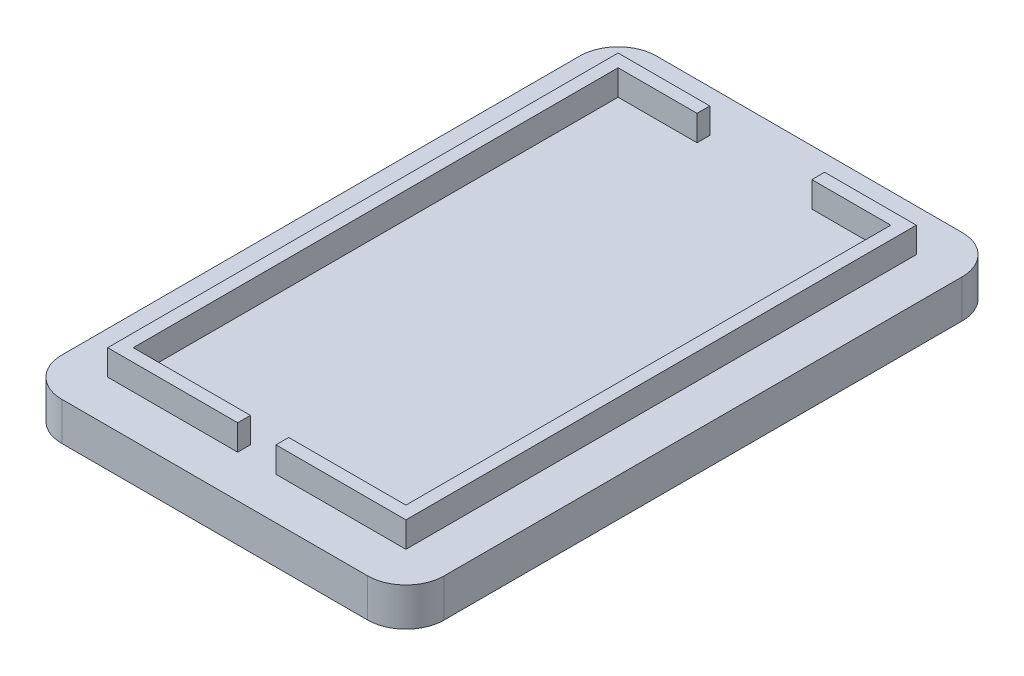
ISO-10303-21;
HEADER;
FILE_DESCRIPTION(('STEP AP214'),'2;1');
FILE_NAME('part.step','',(''),(''),'','','');
FILE_SCHEMA(('AUTOMOTIVE_DESIGN { 1 0 10303 214 1 1 1 1 }'));
ENDSEC;
DATA;
#1=APPLICATION_CONTEXT('core data for automotive mechanical design processes');
#2=APPLICATION_PROTOCOL_DEFINITION('international standard','automotive_design',2000,#1);
#3=PRODUCT_CONTEXT('',#1,'mechanical');
#4=PRODUCT('Part','Part','',(#3));
#5=PRODUCT_RELATED_PRODUCT_CATEGORY('part','',(#4));
#6=PRODUCT_DEFINITION_FORMATION('','',#4);
#7=PRODUCT_DEFINITION_CONTEXT('part definition',#1,'design');
#8=PRODUCT_DEFINITION('design','',#6,#7);
#9=PRODUCT_DEFINITION_SHAPE('','',#8);
#10=(LENGTH_UNIT() NAMED_UNIT(*) SI_UNIT(.MILLI.,.METRE.));
#11=(NAMED_UNIT(*) PLANE_ANGLE_UNIT() SI_UNIT($,.RADIAN.));
#12=(NAMED_UNIT(*) SI_UNIT($,.STERADIAN.) SOLID_ANGLE_UNIT());
#13=UNCERTAINTY_MEASURE_WITH_UNIT(LENGTH_MEASURE(1.E-05),#10,'distance_accuracy_value','');
#14=(GEOMETRIC_REPRESENTATION_CONTEXT(3) GLOBAL_UNCERTAINTY_ASSIGNED_CONTEXT((#13)) GLOBAL_UNIT_ASSIGNED_CONTEXT((#10,
#11,#12)) REPRESENTATION_CONTEXT('',''));
#15=CARTESIAN_POINT('',(0.,0.,0.));
#16=DIRECTION('',(0.,0.,1.));
#17=DIRECTION('',(1.,0.,0.));
#18=AXIS2_PLACEMENT_3D('',#15,#16,#17);
#19=CARTESIAN_POINT('',(-14.985,3.,-23.3));
#20=DIRECTION('',(0.,0.,1.));
#21=DIRECTION('',(1.,0.,0.));
#22=AXIS2_PLACEMENT_3D('',#19,#20,#21);
#23=PLANE('',#22);
#24=DIRECTION('',(-1.,0.,0.));
#25=VECTOR('',#24,1.);
#26=CARTESIAN_POINT('',(-14.985,3.,-23.3));
#27=LINE('',#26,#25);
#28=CARTESIAN_POINT('',(11.985,3.,-23.3));
#29=VERTEX_POINT('',#28);
#30=CARTESIAN_POINT('',(-11.985,3.,-23.3));
#31=VERTEX_POINT('',#30);
#32=EDGE_CURVE('E332',#29,#31,#27,.T.);
#33=ORIENTED_EDGE('',*,*,#32,.F.);
#34=DIRECTION('',(0.,-1.,0.));
#35=VECTOR('',#34,1.);
#36=CARTESIAN_POINT('',(11.985,3.,-23.3));
#37=LINE('',#36,#35);
#38=CARTESIAN_POINT('',(11.985,0.,-23.3));
#39=VERTEX_POINT('',#38);
#40=EDGE_CURVE('E354',#29,#39,#37,.T.);
#41=ORIENTED_EDGE('',*,*,#40,.T.);
#42=DIRECTION('',(-1.,0.,0.));
#43=VECTOR('',#42,1.);
#44=CARTESIAN_POINT('',(-14.985,0.,-23.3));
#45=LINE('',#44,#43);
#46=CARTESIAN_POINT('',(-11.985,0.,-23.3));
#47=VERTEX_POINT('',#46);
#48=EDGE_CURVE('E331',#39,#47,#45,.T.);
#49=ORIENTED_EDGE('',*,*,#48,.T.);
#50=DIRECTION('',(0.,-1.,0.));
#51=VECTOR('',#50,1.);
#52=CARTESIAN_POINT('',(-11.985,3.,-23.3));
#53=LINE('',#52,#51);
#54=EDGE_CURVE('E343',#47,#31,#53,.F.);
#55=ORIENTED_EDGE('',*,*,#54,.T.);
#56=EDGE_LOOP('',(#33,#41,#49,#55));
#57=FACE_BOUND('',#56,.T.);
#58=ADVANCED_FACE('F33',(#57),#23,.F.);
#59=CARTESIAN_POINT('',(-14.985,3.,-23.3));
#60=DIRECTION('',(1.,0.,0.));
#61=DIRECTION('',(0.,0.,-1.));
#62=AXIS2_PLACEMENT_3D('',#59,#60,#61);
#63=PLANE('',#62);
#64=DIRECTION('',(0.,0.,1.));
#65=VECTOR('',#64,1.);
#66=CARTESIAN_POINT('',(-14.985,0.,-23.3));
#67=LINE('',#66,#65);
#68=CARTESIAN_POINT('',(-14.985,0.,-20.3));
#69=VERTEX_POINT('',#68);
#70=CARTESIAN_POINT('',(-14.985,0.,20.3));
#71=VERTEX_POINT('',#70);
#72=EDGE_CURVE('E346',#69,#71,#67,.T.);
#73=ORIENTED_EDGE('',*,*,#72,.T.);
#74=DIRECTION('',(0.,-1.,0.));
#75=VECTOR('',#74,1.);
#76=CARTESIAN_POINT('',(-14.985,3.,20.3));
#77=LINE('',#76,#75);
#78=CARTESIAN_POINT('',(-14.985,3.,20.3));
#79=VERTEX_POINT('',#78);
#80=EDGE_CURVE('E11',#71,#79,#77,.F.);
#81=ORIENTED_EDGE('',*,*,#80,.T.);
#82=DIRECTION('',(0.,0.,1.));
#83=VECTOR('',#82,1.);
#84=CARTESIAN_POINT('',(-14.985,3.,-23.3));
#85=LINE('',#84,#83);
#86=CARTESIAN_POINT('',(-14.985,3.,-20.3));
#87=VERTEX_POINT('',#86);
#88=EDGE_CURVE('E335',#87,#79,#85,.T.);
#89=ORIENTED_EDGE('',*,*,#88,.F.);
#90=DIRECTION('',(0.,-1.,0.));
#91=VECTOR('',#90,1.);
#92=CARTESIAN_POINT('',(-14.985,3.,-20.3));
#93=LINE('',#92,#91);
#94=EDGE_CURVE('E41',#87,#69,#93,.T.);
#95=ORIENTED_EDGE('',*,*,#94,.T.);
#96=EDGE_LOOP('',(#73,#81,#89,#95));
#97=FACE_BOUND('',#96,.T.);
#98=ADVANCED_FACE('F385',(#97),#63,.F.);
#99=CARTESIAN_POINT('',(-14.985,3.,23.3));
#100=DIRECTION('',(0.,0.,-1.));
#101=DIRECTION('',(-1.,0.,0.));
#102=AXIS2_PLACEMENT_3D('',#99,#100,#101);
#103=PLANE('',#102);
#104=DIRECTION('',(1.,0.,0.));
#105=VECTOR('',#104,1.);
#106=CARTESIAN_POINT('',(-14.985,0.,23.3));
#107=LINE('',#106,#105);
#108=CARTESIAN_POINT('',(-11.985,0.,23.3));
#109=VERTEX_POINT('',#108);
#110=CARTESIAN_POINT('',(11.985,0.,23.3));
#111=VERTEX_POINT('',#110);
#112=EDGE_CURVE('E349',#109,#111,#107,.T.);
#113=ORIENTED_EDGE('',*,*,#112,.T.);
#114=DIRECTION('',(0.,-1.,0.));
#115=VECTOR('',#114,1.);
#116=CARTESIAN_POINT('',(11.985,3.,23.3));
#117=LINE('',#116,#115);
#118=CARTESIAN_POINT('',(11.985,3.,23.3));
#119=VERTEX_POINT('',#118);
#120=EDGE_CURVE('E48',#111,#119,#117,.F.);
#121=ORIENTED_EDGE('',*,*,#120,.T.);
#122=DIRECTION('',(1.,0.,0.));
#123=VECTOR('',#122,1.);
#124=CARTESIAN_POINT('',(-14.985,3.,23.3));
#125=LINE('',#124,#123);
#126=CARTESIAN_POINT('',(-11.985,3.,23.3));
#127=VERTEX_POINT('',#126);
#128=EDGE_CURVE('E338',#127,#119,#125,.T.);
#129=ORIENTED_EDGE('',*,*,#128,.F.);
#130=DIRECTION('',(0.,-1.,0.));
#131=VECTOR('',#130,1.);
#132=CARTESIAN_POINT('',(-11.985,3.,23.3));
#133=LINE('',#132,#131);
#134=EDGE_CURVE('E377',#127,#109,#133,.T.);
#135=ORIENTED_EDGE('',*,*,#134,.T.);
#136=EDGE_LOOP('',(#113,#121,#129,#135));
#137=FACE_BOUND('',#136,.T.);
#138=ADVANCED_FACE('F396',(#137),#103,.F.);
#139=CARTESIAN_POINT('',(14.985,3.,-23.3));
#140=DIRECTION('',(-1.,0.,0.));
#141=DIRECTION('',(0.,0.,1.));
#142=AXIS2_PLACEMENT_3D('',#139,#140,#141);
#143=PLANE('',#142);
#144=DIRECTION('',(0.,0.,-1.));
#145=VECTOR('',#144,1.);
#146=CARTESIAN_POINT('',(14.985,0.,-23.3));
#147=LINE('',#146,#145);
#148=CARTESIAN_POINT('',(14.985,0.,20.3));
#149=VERTEX_POINT('',#148);
#150=CARTESIAN_POINT('',(14.985,0.,-20.3));
#151=VERTEX_POINT('',#150);
#152=EDGE_CURVE('E336',#149,#151,#147,.T.);
#153=ORIENTED_EDGE('',*,*,#152,.T.);
#154=DIRECTION('',(0.,-1.,0.));
#155=VECTOR('',#154,1.);
#156=CARTESIAN_POINT('',(14.985,3.,-20.3));
#157=LINE('',#156,#155);
#158=CARTESIAN_POINT('',(14.985,3.,-20.3));
#159=VERTEX_POINT('',#158);
#160=EDGE_CURVE('E368',#151,#159,#157,.F.);
#161=ORIENTED_EDGE('',*,*,#160,.T.);
#162=DIRECTION('',(0.,0.,-1.));
#163=VECTOR('',#162,1.);
#164=CARTESIAN_POINT('',(14.985,3.,-23.3));
#165=LINE('',#164,#163);
#166=CARTESIAN_POINT('',(14.985,3.,20.3));
#167=VERTEX_POINT('',#166);
#168=EDGE_CURVE('E340',#167,#159,#165,.T.);
#169=ORIENTED_EDGE('',*,*,#168,.F.);
#170=DIRECTION('',(0.,-1.,0.));
#171=VECTOR('',#170,1.);
#172=CARTESIAN_POINT('',(14.985,3.,20.3));
#173=LINE('',#172,#171);
#174=EDGE_CURVE('E365',#167,#149,#173,.T.);
#175=ORIENTED_EDGE('',*,*,#174,.T.);
#176=EDGE_LOOP('',(#153,#161,#169,#175));
#177=FACE_BOUND('',#176,.T.);
#178=ADVANCED_FACE('F405',(#177),#143,.F.);
#179=CARTESIAN_POINT('',(0.,3.,0.));
#180=DIRECTION('',(0.,-1.,0.));
#181=DIRECTION('',(0.,0.,-1.));
#182=AXIS2_PLACEMENT_3D('',#179,#180,#181);
#183=PLANE('',#182);
#184=DIRECTION('',(0.,0.,1.));
#185=VECTOR('',#184,1.);
#186=CARTESIAN_POINT('',(1.50000000000001,3.,0.));
#187=LINE('',#186,#185);
#188=CARTESIAN_POINT('',(1.50000000000001,3.,19.));
#189=VERTEX_POINT('',#188);
#190=CARTESIAN_POINT('',(1.50000000000001,3.,20.));
#191=VERTEX_POINT('',#190);
#192=EDGE_CURVE('E239',#189,#191,#187,.T.);
#193=ORIENTED_EDGE('',*,*,#192,.F.);
#194=DIRECTION('',(1.,0.,0.));
#195=VECTOR('',#194,1.);
#196=CARTESIAN_POINT('',(0.,3.,19.));
#197=LINE('',#196,#195);
#198=CARTESIAN_POINT('',(10.685,3.,19.));
#199=VERTEX_POINT('',#198);
#200=EDGE_CURVE('E202',#189,#199,#197,.T.);
#201=ORIENTED_EDGE('',*,*,#200,.T.);
#202=DIRECTION('',(0.,0.,-1.));
#203=VECTOR('',#202,1.);
#204=CARTESIAN_POINT('',(10.685,3.,0.));
#205=LINE('',#204,#203);
#206=CARTESIAN_POINT('',(10.685,3.,-19.));
#207=VERTEX_POINT('',#206);
#208=EDGE_CURVE('E220',#199,#207,#205,.T.);
#209=ORIENTED_EDGE('',*,*,#208,.T.);
#210=DIRECTION('',(-1.,0.,0.));
#211=VECTOR('',#210,1.);
#212=CARTESIAN_POINT('',(0.,3.,-19.));
#213=LINE('',#212,#211);
#214=CARTESIAN_POINT('',(4.5,3.,-19.));
#215=VERTEX_POINT('',#214);
#216=EDGE_CURVE('E223',#207,#215,#213,.T.);
#217=ORIENTED_EDGE('',*,*,#216,.T.);
#218=DIRECTION('',(0.,0.,1.));
#219=VECTOR('',#218,1.);
#220=CARTESIAN_POINT('',(4.50000000000002,3.,0.));
#221=LINE('',#220,#219);
#222=CARTESIAN_POINT('',(4.5,3.,-20.));
#223=VERTEX_POINT('',#222);
#224=EDGE_CURVE('E247',#223,#215,#221,.T.);
#225=ORIENTED_EDGE('',*,*,#224,.F.);
#226=DIRECTION('',(-1.,0.,0.));
#227=VECTOR('',#226,1.);
#228=CARTESIAN_POINT('',(0.,3.,-20.));
#229=LINE('',#228,#227);
#230=CARTESIAN_POINT('',(11.685,3.,-20.));
#231=VERTEX_POINT('',#230);
#232=EDGE_CURVE('E245',#231,#223,#229,.T.);
#233=ORIENTED_EDGE('',*,*,#232,.F.);
#234=DIRECTION('',(0.,0.,-1.));
#235=VECTOR('',#234,1.);
#236=CARTESIAN_POINT('',(11.685,3.,0.));
#237=LINE('',#236,#235);
#238=CARTESIAN_POINT('',(11.685,3.,20.));
#239=VERTEX_POINT('',#238);
#240=EDGE_CURVE('E243',#239,#231,#237,.T.);
#241=ORIENTED_EDGE('',*,*,#240,.F.);
#242=DIRECTION('',(1.,0.,0.));
#243=VECTOR('',#242,1.);
#244=CARTESIAN_POINT('',(0.,3.,20.));
#245=LINE('',#244,#243);
#246=EDGE_CURVE('E241',#191,#239,#245,.T.);
#247=ORIENTED_EDGE('',*,*,#246,.F.);
#248=EDGE_LOOP('',(#193,#201,#209,#217,#225,#233,#241,#247));
#249=FACE_BOUND('',#248,.T.);
#250=DIRECTION('',(1.,0.,0.));
#251=VECTOR('',#250,1.);
#252=CARTESIAN_POINT('',(0.,3.,19.));
#253=LINE('',#252,#251);
#254=CARTESIAN_POINT('',(-10.685,3.,19.));
#255=VERTEX_POINT('',#254);
#256=CARTESIAN_POINT('',(-1.49999999999999,3.,19.));
#257=VERTEX_POINT('',#256);
#258=EDGE_CURVE('E292',#255,#257,#253,.T.);
#259=ORIENTED_EDGE('',*,*,#258,.T.);
#260=DIRECTION('',(0.,0.,1.));
#261=VECTOR('',#260,1.);
#262=CARTESIAN_POINT('',(-1.49999999999999,3.,0.));
#263=LINE('',#262,#261);
#264=CARTESIAN_POINT('',(-1.49999999999999,3.,20.));
#265=VERTEX_POINT('',#264);
#266=EDGE_CURVE('E205',#257,#265,#263,.T.);
#267=ORIENTED_EDGE('',*,*,#266,.T.);
#268=DIRECTION('',(1.,0.,0.));
#269=VECTOR('',#268,1.);
#270=CARTESIAN_POINT('',(0.,3.,20.));
#271=LINE('',#270,#269);
#272=CARTESIAN_POINT('',(-11.685,3.,20.));
#273=VERTEX_POINT('',#272);
#274=EDGE_CURVE('E272',#273,#265,#271,.T.);
#275=ORIENTED_EDGE('',*,*,#274,.F.);
#276=DIRECTION('',(0.,0.,1.));
#277=VECTOR('',#276,1.);
#278=CARTESIAN_POINT('',(-11.685,3.,0.));
#279=LINE('',#278,#277);
#280=CARTESIAN_POINT('',(-11.685,3.,-20.));
#281=VERTEX_POINT('',#280);
#282=EDGE_CURVE('E303',#281,#273,#279,.T.);
#283=ORIENTED_EDGE('',*,*,#282,.F.);
#284=DIRECTION('',(-1.,0.,0.));
#285=VECTOR('',#284,1.);
#286=CARTESIAN_POINT('',(0.,3.,-20.));
#287=LINE('',#286,#285);
#288=CARTESIAN_POINT('',(-4.5,3.,-20.));
#289=VERTEX_POINT('',#288);
#290=EDGE_CURVE('E300',#289,#281,#287,.T.);
#291=ORIENTED_EDGE('',*,*,#290,.F.);
#292=DIRECTION('',(0.,0.,1.));
#293=VECTOR('',#292,1.);
#294=CARTESIAN_POINT('',(-4.49999999999998,3.,0.));
#295=LINE('',#294,#293);
#296=CARTESIAN_POINT('',(-4.5,3.,-19.));
#297=VERTEX_POINT('',#296);
#298=EDGE_CURVE('E298',#289,#297,#295,.T.);
#299=ORIENTED_EDGE('',*,*,#298,.T.);
#300=DIRECTION('',(-1.,0.,0.));
#301=VECTOR('',#300,1.);
#302=CARTESIAN_POINT('',(0.,3.,-19.));
#303=LINE('',#302,#301);
#304=CARTESIAN_POINT('',(-10.685,3.,-19.));
#305=VERTEX_POINT('',#304);
#306=EDGE_CURVE('E296',#297,#305,#303,.T.);
#307=ORIENTED_EDGE('',*,*,#306,.T.);
#308=DIRECTION('',(0.,0.,1.));
#309=VECTOR('',#308,1.);
#310=CARTESIAN_POINT('',(-10.685,3.,0.));
#311=LINE('',#310,#309);
#312=EDGE_CURVE('E294',#305,#255,#311,.T.);
#313=ORIENTED_EDGE('',*,*,#312,.T.);
#314=EDGE_LOOP('',(#259,#267,#275,#283,#291,#299,#307,#313));
#315=FACE_BOUND('',#314,.T.);
#316=ORIENTED_EDGE('',*,*,#168,.T.);
#317=CARTESIAN_POINT('',(11.985,3.,-20.3));
#318=DIRECTION('',(0.,-1.,0.));
#319=DIRECTION('',(0.,0.,-1.));
#320=AXIS2_PLACEMENT_3D('',#317,#318,#319);
#321=CIRCLE('',#320,3.);
#322=EDGE_CURVE('E375',#159,#29,#321,.F.);
#323=ORIENTED_EDGE('',*,*,#322,.T.);
#324=ORIENTED_EDGE('',*,*,#32,.T.);
#325=CARTESIAN_POINT('',(-11.985,3.,-20.3));
#326=DIRECTION('',(0.,-1.,0.));
#327=DIRECTION('',(0.,0.,-1.));
#328=AXIS2_PLACEMENT_3D('',#325,#326,#327);
#329=CIRCLE('',#328,3.);
#330=EDGE_CURVE('E370',#31,#87,#329,.F.);
#331=ORIENTED_EDGE('',*,*,#330,.T.);
#332=ORIENTED_EDGE('',*,*,#88,.T.);
#333=CARTESIAN_POINT('',(-11.985,3.,20.3));
#334=DIRECTION('',(0.,-1.,0.));
#335=DIRECTION('',(0.,0.,-1.));
#336=AXIS2_PLACEMENT_3D('',#333,#334,#335);
#337=CIRCLE('',#336,3.);
#338=EDGE_CURVE('E55',#79,#127,#337,.F.);
#339=ORIENTED_EDGE('',*,*,#338,.T.);
#340=ORIENTED_EDGE('',*,*,#128,.T.);
#341=CARTESIAN_POINT('',(11.985,3.,20.3));
#342=DIRECTION('',(0.,-1.,0.));
#343=DIRECTION('',(0.,0.,-1.));
#344=AXIS2_PLACEMENT_3D('',#341,#342,#343);
#345=CIRCLE('',#344,3.);
#346=EDGE_CURVE('E373',#119,#167,#345,.F.);
#347=ORIENTED_EDGE('',*,*,#346,.T.);
#348=EDGE_LOOP('',(#316,#323,#324,#331,#332,#339,#340,#347));
#349=FACE_BOUND('',#348,.T.);
#350=ADVANCED_FACE('F398',(#249,#315,#349),#183,.F.);
#351=CARTESIAN_POINT('',(0.,0.,0.));
#352=DIRECTION('',(0.,-1.,0.));
#353=DIRECTION('',(0.,0.,-1.));
#354=AXIS2_PLACEMENT_3D('',#351,#352,#353);
#355=PLANE('',#354);
#356=ORIENTED_EDGE('',*,*,#48,.F.);
#357=CARTESIAN_POINT('',(11.985,0.,-20.3));
#358=DIRECTION('',(0.,-1.,0.));
#359=DIRECTION('',(0.,0.,-1.));
#360=AXIS2_PLACEMENT_3D('',#357,#358,#359);
#361=CIRCLE('',#360,3.);
#362=EDGE_CURVE('E363',#39,#151,#361,.T.);
#363=ORIENTED_EDGE('',*,*,#362,.T.);
#364=ORIENTED_EDGE('',*,*,#152,.F.);
#365=CARTESIAN_POINT('',(11.985,0.,20.3));
#366=DIRECTION('',(0.,-1.,0.));
#367=DIRECTION('',(0.,0.,-1.));
#368=AXIS2_PLACEMENT_3D('',#365,#366,#367);
#369=CIRCLE('',#368,3.);
#370=EDGE_CURVE('E361',#149,#111,#369,.T.);
#371=ORIENTED_EDGE('',*,*,#370,.T.);
#372=ORIENTED_EDGE('',*,*,#112,.F.);
#373=CARTESIAN_POINT('',(-11.985,0.,20.3));
#374=DIRECTION('',(0.,-1.,0.));
#375=DIRECTION('',(0.,0.,-1.));
#376=AXIS2_PLACEMENT_3D('',#373,#374,#375);
#377=CIRCLE('',#376,3.);
#378=EDGE_CURVE('E359',#109,#71,#377,.T.);
#379=ORIENTED_EDGE('',*,*,#378,.T.);
#380=ORIENTED_EDGE('',*,*,#72,.F.);
#381=CARTESIAN_POINT('',(-11.985,0.,-20.3));
#382=DIRECTION('',(0.,-1.,0.));
#383=DIRECTION('',(0.,0.,-1.));
#384=AXIS2_PLACEMENT_3D('',#381,#382,#383);
#385=CIRCLE('',#384,3.);
#386=EDGE_CURVE('E357',#69,#47,#385,.T.);
#387=ORIENTED_EDGE('',*,*,#386,.T.);
#388=EDGE_LOOP('',(#356,#363,#364,#371,#372,#379,#380,#387));
#389=FACE_BOUND('',#388,.T.);
#390=ADVANCED_FACE('F391',(#389),#355,.T.);
#391=CARTESIAN_POINT('',(-1.49999999999999,5.,0.));
#392=DIRECTION('',(1.,0.,0.));
#393=DIRECTION('',(0.,0.,-1.));
#394=AXIS2_PLACEMENT_3D('',#391,#392,#393);
#395=PLANE('',#394);
#396=ORIENTED_EDGE('',*,*,#266,.F.);
#397=DIRECTION('',(0.,-1.,0.));
#398=VECTOR('',#397,1.);
#399=CARTESIAN_POINT('',(-1.49999999999999,5.,19.));
#400=LINE('',#399,#398);
#401=CARTESIAN_POINT('',(-1.49999999999999,5.,19.));
#402=VERTEX_POINT('',#401);
#403=EDGE_CURVE('E328',#402,#257,#400,.T.);
#404=ORIENTED_EDGE('',*,*,#403,.F.);
#405=DIRECTION('',(0.,0.,1.));
#406=VECTOR('',#405,1.);
#407=CARTESIAN_POINT('',(-1.49999999999999,5.,0.));
#408=LINE('',#407,#406);
#409=CARTESIAN_POINT('',(-1.49999999999999,5.,20.));
#410=VERTEX_POINT('',#409);
#411=EDGE_CURVE('E268',#402,#410,#408,.T.);
#412=ORIENTED_EDGE('',*,*,#411,.T.);
#413=DIRECTION('',(0.,-1.,0.));
#414=VECTOR('',#413,1.);
#415=CARTESIAN_POINT('',(-1.49999999999999,5.,20.));
#416=LINE('',#415,#414);
#417=EDGE_CURVE('E290',#410,#265,#416,.T.);
#418=ORIENTED_EDGE('',*,*,#417,.T.);
#419=EDGE_LOOP('',(#396,#404,#412,#418));
#420=FACE_BOUND('',#419,.T.);
#421=ADVANCED_FACE('F597',(#420),#395,.T.);
#422=CARTESIAN_POINT('',(0.,5.,19.));
#423=DIRECTION('',(0.,0.,-1.));
#424=DIRECTION('',(-1.,0.,0.));
#425=AXIS2_PLACEMENT_3D('',#422,#423,#424);
#426=PLANE('',#425);
#427=ORIENTED_EDGE('',*,*,#258,.F.);
#428=DIRECTION('',(0.,-1.,0.));
#429=VECTOR('',#428,1.);
#430=CARTESIAN_POINT('',(-10.685,5.,19.));
#431=LINE('',#430,#429);
#432=CARTESIAN_POINT('',(-10.685,5.,19.));
#433=VERTEX_POINT('',#432);
#434=EDGE_CURVE('E325',#433,#255,#431,.T.);
#435=ORIENTED_EDGE('',*,*,#434,.F.);
#436=DIRECTION('',(1.,0.,0.));
#437=VECTOR('',#436,1.);
#438=CARTESIAN_POINT('',(0.,5.,19.));
#439=LINE('',#438,#437);
#440=EDGE_CURVE('E271',#433,#402,#439,.T.);
#441=ORIENTED_EDGE('',*,*,#440,.T.);
#442=ORIENTED_EDGE('',*,*,#403,.T.);
#443=EDGE_LOOP('',(#427,#435,#441,#442));
#444=FACE_BOUND('',#443,.T.);
#445=ADVANCED_FACE('F588',(#444),#426,.T.);
#446=CARTESIAN_POINT('',(-10.685,5.,0.));
#447=DIRECTION('',(1.,0.,0.));
#448=DIRECTION('',(0.,0.,-1.));
#449=AXIS2_PLACEMENT_3D('',#446,#447,#448);
#450=PLANE('',#449);
#451=ORIENTED_EDGE('',*,*,#312,.F.);
#452=DIRECTION('',(0.,-1.,0.));
#453=VECTOR('',#452,1.);
#454=CARTESIAN_POINT('',(-10.685,5.,-19.));
#455=LINE('',#454,#453);
#456=CARTESIAN_POINT('',(-10.685,5.,-19.));
#457=VERTEX_POINT('',#456);
#458=EDGE_CURVE('E322',#457,#305,#455,.T.);
#459=ORIENTED_EDGE('',*,*,#458,.F.);
#460=DIRECTION('',(0.,0.,1.));
#461=VECTOR('',#460,1.);
#462=CARTESIAN_POINT('',(-10.685,5.,0.));
#463=LINE('',#462,#461);
#464=EDGE_CURVE('E275',#457,#433,#463,.T.);
#465=ORIENTED_EDGE('',*,*,#464,.T.);
#466=ORIENTED_EDGE('',*,*,#434,.T.);
#467=EDGE_LOOP('',(#451,#459,#465,#466));
#468=FACE_BOUND('',#467,.T.);
#469=ADVANCED_FACE('F579',(#468),#450,.T.);
#470=CARTESIAN_POINT('',(0.,5.,-19.));
#471=DIRECTION('',(0.,0.,1.));
#472=DIRECTION('',(1.,0.,0.));
#473=AXIS2_PLACEMENT_3D('',#470,#471,#472);
#474=PLANE('',#473);
#475=ORIENTED_EDGE('',*,*,#306,.F.);
#476=DIRECTION('',(0.,-1.,0.));
#477=VECTOR('',#476,1.);
#478=CARTESIAN_POINT('',(-4.5,5.,-19.));
#479=LINE('',#478,#477);
#480=CARTESIAN_POINT('',(-4.5,5.,-19.));
#481=VERTEX_POINT('',#480);
#482=EDGE_CURVE('E319',#481,#297,#479,.T.);
#483=ORIENTED_EDGE('',*,*,#482,.F.);
#484=DIRECTION('',(-1.,0.,0.));
#485=VECTOR('',#484,1.);
#486=CARTESIAN_POINT('',(0.,5.,-19.));
#487=LINE('',#486,#485);
#488=EDGE_CURVE('E278',#481,#457,#487,.T.);
#489=ORIENTED_EDGE('',*,*,#488,.T.);
#490=ORIENTED_EDGE('',*,*,#458,.T.);
#491=EDGE_LOOP('',(#475,#483,#489,#490));
#492=FACE_BOUND('',#491,.T.);
#493=ADVANCED_FACE('F570',(#492),#474,.T.);
#494=CARTESIAN_POINT('',(-4.49999999999998,5.,0.));
#495=DIRECTION('',(1.,0.,0.));
#496=DIRECTION('',(0.,0.,-1.));
#497=AXIS2_PLACEMENT_3D('',#494,#495,#496);
#498=PLANE('',#497);
#499=ORIENTED_EDGE('',*,*,#298,.F.);
#500=DIRECTION('',(0.,-1.,0.));
#501=VECTOR('',#500,1.);
#502=CARTESIAN_POINT('',(-4.5,5.,-20.));
#503=LINE('',#502,#501);
#504=CARTESIAN_POINT('',(-4.5,5.,-20.));
#505=VERTEX_POINT('',#504);
#506=EDGE_CURVE('E316',#505,#289,#503,.T.);
#507=ORIENTED_EDGE('',*,*,#506,.F.);
#508=DIRECTION('',(0.,0.,1.));
#509=VECTOR('',#508,1.);
#510=CARTESIAN_POINT('',(-4.49999999999998,5.,0.));
#511=LINE('',#510,#509);
#512=EDGE_CURVE('E281',#505,#481,#511,.T.);
#513=ORIENTED_EDGE('',*,*,#512,.T.);
#514=ORIENTED_EDGE('',*,*,#482,.T.);
#515=EDGE_LOOP('',(#499,#507,#513,#514));
#516=FACE_BOUND('',#515,.T.);
#517=ADVANCED_FACE('F561',(#516),#498,.T.);
#518=CARTESIAN_POINT('',(0.,5.,-20.));
#519=DIRECTION('',(0.,0.,1.));
#520=DIRECTION('',(1.,0.,0.));
#521=AXIS2_PLACEMENT_3D('',#518,#519,#520);
#522=PLANE('',#521);
#523=ORIENTED_EDGE('',*,*,#290,.T.);
#524=DIRECTION('',(0.,-1.,0.));
#525=VECTOR('',#524,1.);
#526=CARTESIAN_POINT('',(-11.685,5.,-20.));
#527=LINE('',#526,#525);
#528=CARTESIAN_POINT('',(-11.685,5.,-20.));
#529=VERTEX_POINT('',#528);
#530=EDGE_CURVE('E313',#529,#281,#527,.T.);
#531=ORIENTED_EDGE('',*,*,#530,.F.);
#532=DIRECTION('',(-1.,0.,0.));
#533=VECTOR('',#532,1.);
#534=CARTESIAN_POINT('',(0.,5.,-20.));
#535=LINE('',#534,#533);
#536=EDGE_CURVE('E284',#505,#529,#535,.T.);
#537=ORIENTED_EDGE('',*,*,#536,.F.);
#538=ORIENTED_EDGE('',*,*,#506,.T.);
#539=EDGE_LOOP('',(#523,#531,#537,#538));
#540=FACE_BOUND('',#539,.T.);
#541=ADVANCED_FACE('F552',(#540),#522,.F.);
#542=CARTESIAN_POINT('',(-11.685,5.,0.));
#543=DIRECTION('',(1.,0.,0.));
#544=DIRECTION('',(0.,0.,-1.));
#545=AXIS2_PLACEMENT_3D('',#542,#543,#544);
#546=PLANE('',#545);
#547=ORIENTED_EDGE('',*,*,#282,.T.);
#548=DIRECTION('',(0.,-1.,0.));
#549=VECTOR('',#548,1.);
#550=CARTESIAN_POINT('',(-11.685,5.,20.));
#551=LINE('',#550,#549);
#552=CARTESIAN_POINT('',(-11.685,5.,20.));
#553=VERTEX_POINT('',#552);
#554=EDGE_CURVE('E310',#553,#273,#551,.T.);
#555=ORIENTED_EDGE('',*,*,#554,.F.);
#556=DIRECTION('',(0.,0.,1.));
#557=VECTOR('',#556,1.);
#558=CARTESIAN_POINT('',(-11.685,5.,0.));
#559=LINE('',#558,#557);
#560=EDGE_CURVE('E286',#529,#553,#559,.T.);
#561=ORIENTED_EDGE('',*,*,#560,.F.);
#562=ORIENTED_EDGE('',*,*,#530,.T.);
#563=EDGE_LOOP('',(#547,#555,#561,#562));
#564=FACE_BOUND('',#563,.T.);
#565=ADVANCED_FACE('F543',(#564),#546,.F.);
#566=CARTESIAN_POINT('',(0.,5.,20.));
#567=DIRECTION('',(0.,0.,-1.));
#568=DIRECTION('',(-1.,0.,0.));
#569=AXIS2_PLACEMENT_3D('',#566,#567,#568);
#570=PLANE('',#569);
#571=ORIENTED_EDGE('',*,*,#274,.T.);
#572=ORIENTED_EDGE('',*,*,#417,.F.);
#573=DIRECTION('',(1.,0.,0.));
#574=VECTOR('',#573,1.);
#575=CARTESIAN_POINT('',(0.,5.,20.));
#576=LINE('',#575,#574);
#577=EDGE_CURVE('E288',#553,#410,#576,.T.);
#578=ORIENTED_EDGE('',*,*,#577,.F.);
#579=ORIENTED_EDGE('',*,*,#554,.T.);
#580=EDGE_LOOP('',(#571,#572,#578,#579));
#581=FACE_BOUND('',#580,.T.);
#582=ADVANCED_FACE('F534',(#581),#570,.F.);
#583=CARTESIAN_POINT('',(0.,5.,0.));
#584=DIRECTION('',(0.,1.,0.));
#585=DIRECTION('',(0.,0.,1.));
#586=AXIS2_PLACEMENT_3D('',#583,#584,#585);
#587=PLANE('',#586);
#588=ORIENTED_EDGE('',*,*,#411,.F.);
#589=ORIENTED_EDGE('',*,*,#440,.F.);
#590=ORIENTED_EDGE('',*,*,#464,.F.);
#591=ORIENTED_EDGE('',*,*,#488,.F.);
#592=ORIENTED_EDGE('',*,*,#512,.F.);
#593=ORIENTED_EDGE('',*,*,#536,.T.);
#594=ORIENTED_EDGE('',*,*,#560,.T.);
#595=ORIENTED_EDGE('',*,*,#577,.T.);
#596=EDGE_LOOP('',(#588,#589,#590,#591,#592,#593,#594,#595));
#597=FACE_BOUND('',#596,.T.);
#598=ADVANCED_FACE('F526',(#597),#587,.T.);
#599=CARTESIAN_POINT('',(0.,5.,19.));
#600=DIRECTION('',(0.,0.,-1.));
#601=DIRECTION('',(-1.,0.,0.));
#602=AXIS2_PLACEMENT_3D('',#599,#600,#601);
#603=PLANE('',#602);
#604=ORIENTED_EDGE('',*,*,#200,.F.);
#605=DIRECTION('',(0.,-1.,0.));
#606=VECTOR('',#605,1.);
#607=CARTESIAN_POINT('',(1.50000000000001,5.,19.));
#608=LINE('',#607,#606);
#609=CARTESIAN_POINT('',(1.50000000000001,5.,19.));
#610=VERTEX_POINT('',#609);
#611=EDGE_CURVE('E195',#610,#189,#608,.T.);
#612=ORIENTED_EDGE('',*,*,#611,.F.);
#613=DIRECTION('',(1.,0.,0.));
#614=VECTOR('',#613,1.);
#615=CARTESIAN_POINT('',(0.,5.,19.));
#616=LINE('',#615,#614);
#617=CARTESIAN_POINT('',(10.685,5.,19.));
#618=VERTEX_POINT('',#617);
#619=EDGE_CURVE('E199',#610,#618,#616,.T.);
#620=ORIENTED_EDGE('',*,*,#619,.T.);
#621=DIRECTION('',(0.,-1.,0.));
#622=VECTOR('',#621,1.);
#623=CARTESIAN_POINT('',(10.685,5.,19.));
#624=LINE('',#623,#622);
#625=EDGE_CURVE('E237',#618,#199,#624,.T.);
#626=ORIENTED_EDGE('',*,*,#625,.T.);
#627=EDGE_LOOP('',(#604,#612,#620,#626));
#628=FACE_BOUND('',#627,.T.);
#629=ADVANCED_FACE('F197',(#628),#603,.T.);
#630=CARTESIAN_POINT('',(1.50000000000001,5.,0.));
#631=DIRECTION('',(1.,0.,0.));
#632=DIRECTION('',(0.,0.,-1.));
#633=AXIS2_PLACEMENT_3D('',#630,#631,#632);
#634=PLANE('',#633);
#635=ORIENTED_EDGE('',*,*,#192,.T.);
#636=DIRECTION('',(0.,-1.,0.));
#637=VECTOR('',#636,1.);
#638=CARTESIAN_POINT('',(1.50000000000001,5.,20.));
#639=LINE('',#638,#637);
#640=CARTESIAN_POINT('',(1.50000000000001,5.,20.));
#641=VERTEX_POINT('',#640);
#642=EDGE_CURVE('E206',#641,#191,#639,.T.);
#643=ORIENTED_EDGE('',*,*,#642,.F.);
#644=DIRECTION('',(0.,0.,1.));
#645=VECTOR('',#644,1.);
#646=CARTESIAN_POINT('',(1.50000000000001,5.,0.));
#647=LINE('',#646,#645);
#648=EDGE_CURVE('E209',#610,#641,#647,.T.);
#649=ORIENTED_EDGE('',*,*,#648,.F.);
#650=ORIENTED_EDGE('',*,*,#611,.T.);
#651=EDGE_LOOP('',(#635,#643,#649,#650));
#652=FACE_BOUND('',#651,.T.);
#653=ADVANCED_FACE('F210',(#652),#634,.F.);
#654=CARTESIAN_POINT('',(0.,5.,20.));
#655=DIRECTION('',(0.,0.,-1.));
#656=DIRECTION('',(-1.,0.,0.));
#657=AXIS2_PLACEMENT_3D('',#654,#655,#656);
#658=PLANE('',#657);
#659=ORIENTED_EDGE('',*,*,#246,.T.);
#660=DIRECTION('',(0.,-1.,0.));
#661=VECTOR('',#660,1.);
#662=CARTESIAN_POINT('',(11.685,5.,20.));
#663=LINE('',#662,#661);
#664=CARTESIAN_POINT('',(11.685,5.,20.));
#665=VERTEX_POINT('',#664);
#666=EDGE_CURVE('E264',#665,#239,#663,.T.);
#667=ORIENTED_EDGE('',*,*,#666,.F.);
#668=DIRECTION('',(1.,0.,0.));
#669=VECTOR('',#668,1.);
#670=CARTESIAN_POINT('',(0.,5.,20.));
#671=LINE('',#670,#669);
#672=EDGE_CURVE('E214',#641,#665,#671,.T.);
#673=ORIENTED_EDGE('',*,*,#672,.F.);
#674=ORIENTED_EDGE('',*,*,#642,.T.);
#675=EDGE_LOOP('',(#659,#667,#673,#674));
#676=FACE_BOUND('',#675,.T.);
#677=ADVANCED_FACE('F502',(#676),#658,.F.);
#678=CARTESIAN_POINT('',(11.685,5.,0.));
#679=DIRECTION('',(-1.,0.,0.));
#680=DIRECTION('',(0.,0.,1.));
#681=AXIS2_PLACEMENT_3D('',#678,#679,#680);
#682=PLANE('',#681);
#683=ORIENTED_EDGE('',*,*,#240,.T.);
#684=DIRECTION('',(0.,-1.,0.));
#685=VECTOR('',#684,1.);
#686=CARTESIAN_POINT('',(11.685,5.,-20.));
#687=LINE('',#686,#685);
#688=CARTESIAN_POINT('',(11.685,5.,-20.));
#689=VERTEX_POINT('',#688);
#690=EDGE_CURVE('E261',#689,#231,#687,.T.);
#691=ORIENTED_EDGE('',*,*,#690,.F.);
#692=DIRECTION('',(0.,0.,-1.));
#693=VECTOR('',#692,1.);
#694=CARTESIAN_POINT('',(11.685,5.,0.));
#695=LINE('',#694,#693);
#696=EDGE_CURVE('E227',#665,#689,#695,.T.);
#697=ORIENTED_EDGE('',*,*,#696,.F.);
#698=ORIENTED_EDGE('',*,*,#666,.T.);
#699=EDGE_LOOP('',(#683,#691,#697,#698));
#700=FACE_BOUND('',#699,.T.);
#701=ADVANCED_FACE('F493',(#700),#682,.F.);
#702=CARTESIAN_POINT('',(0.,5.,-20.));
#703=DIRECTION('',(0.,0.,1.));
#704=DIRECTION('',(1.,0.,0.));
#705=AXIS2_PLACEMENT_3D('',#702,#703,#704);
#706=PLANE('',#705);
#707=ORIENTED_EDGE('',*,*,#232,.T.);
#708=DIRECTION('',(0.,-1.,0.));
#709=VECTOR('',#708,1.);
#710=CARTESIAN_POINT('',(4.5,5.,-20.));
#711=LINE('',#710,#709);
#712=CARTESIAN_POINT('',(4.5,5.,-20.));
#713=VERTEX_POINT('',#712);
#714=EDGE_CURVE('E258',#713,#223,#711,.T.);
#715=ORIENTED_EDGE('',*,*,#714,.F.);
#716=DIRECTION('',(-1.,0.,0.));
#717=VECTOR('',#716,1.);
#718=CARTESIAN_POINT('',(0.,5.,-20.));
#719=LINE('',#718,#717);
#720=EDGE_CURVE('E229',#689,#713,#719,.T.);
#721=ORIENTED_EDGE('',*,*,#720,.F.);
#722=ORIENTED_EDGE('',*,*,#690,.T.);
#723=EDGE_LOOP('',(#707,#715,#721,#722));
#724=FACE_BOUND('',#723,.T.);
#725=ADVANCED_FACE('F484',(#724),#706,.F.);
#726=CARTESIAN_POINT('',(4.50000000000002,5.,0.));
#727=DIRECTION('',(1.,0.,0.));
#728=DIRECTION('',(0.,0.,-1.));
#729=AXIS2_PLACEMENT_3D('',#726,#727,#728);
#730=PLANE('',#729);
#731=ORIENTED_EDGE('',*,*,#224,.T.);
#732=DIRECTION('',(0.,-1.,0.));
#733=VECTOR('',#732,1.);
#734=CARTESIAN_POINT('',(4.5,5.,-19.));
#735=LINE('',#734,#733);
#736=CARTESIAN_POINT('',(4.5,5.,-19.));
#737=VERTEX_POINT('',#736);
#738=EDGE_CURVE('E256',#737,#215,#735,.T.);
#739=ORIENTED_EDGE('',*,*,#738,.F.);
#740=DIRECTION('',(0.,0.,1.));
#741=VECTOR('',#740,1.);
#742=CARTESIAN_POINT('',(4.50000000000002,5.,0.));
#743=LINE('',#742,#741);
#744=EDGE_CURVE('E231',#713,#737,#743,.T.);
#745=ORIENTED_EDGE('',*,*,#744,.F.);
#746=ORIENTED_EDGE('',*,*,#714,.T.);
#747=EDGE_LOOP('',(#731,#739,#745,#746));
#748=FACE_BOUND('',#747,.T.);
#749=ADVANCED_FACE('F475',(#748),#730,.F.);
#750=CARTESIAN_POINT('',(0.,5.,-19.));
#751=DIRECTION('',(0.,0.,1.));
#752=DIRECTION('',(1.,0.,0.));
#753=AXIS2_PLACEMENT_3D('',#750,#751,#752);
#754=PLANE('',#753);
#755=ORIENTED_EDGE('',*,*,#216,.F.);
#756=DIRECTION('',(0.,-1.,0.));
#757=VECTOR('',#756,1.);
#758=CARTESIAN_POINT('',(10.685,5.,-19.));
#759=LINE('',#758,#757);
#760=CARTESIAN_POINT('',(10.685,5.,-19.));
#761=VERTEX_POINT('',#760);
#762=EDGE_CURVE('E253',#761,#207,#759,.T.);
#763=ORIENTED_EDGE('',*,*,#762,.F.);
#764=DIRECTION('',(-1.,0.,0.));
#765=VECTOR('',#764,1.);
#766=CARTESIAN_POINT('',(0.,5.,-19.));
#767=LINE('',#766,#765);
#768=EDGE_CURVE('E233',#761,#737,#767,.T.);
#769=ORIENTED_EDGE('',*,*,#768,.T.);
#770=ORIENTED_EDGE('',*,*,#738,.T.);
#771=EDGE_LOOP('',(#755,#763,#769,#770));
#772=FACE_BOUND('',#771,.T.);
#773=ADVANCED_FACE('F466',(#772),#754,.T.);
#774=CARTESIAN_POINT('',(10.685,5.,0.));
#775=DIRECTION('',(-1.,0.,0.));
#776=DIRECTION('',(0.,0.,1.));
#777=AXIS2_PLACEMENT_3D('',#774,#775,#776);
#778=PLANE('',#777);
#779=ORIENTED_EDGE('',*,*,#208,.F.);
#780=ORIENTED_EDGE('',*,*,#625,.F.);
#781=DIRECTION('',(0.,0.,-1.));
#782=VECTOR('',#781,1.);
#783=CARTESIAN_POINT('',(10.685,5.,0.));
#784=LINE('',#783,#782);
#785=EDGE_CURVE('E219',#618,#761,#784,.T.);
#786=ORIENTED_EDGE('',*,*,#785,.T.);
#787=ORIENTED_EDGE('',*,*,#762,.T.);
#788=EDGE_LOOP('',(#779,#780,#786,#787));
#789=FACE_BOUND('',#788,.T.);
#790=ADVANCED_FACE('F458',(#789),#778,.T.);
#791=CARTESIAN_POINT('',(0.,5.,0.));
#792=DIRECTION('',(0.,1.,0.));
#793=DIRECTION('',(0.,0.,1.));
#794=AXIS2_PLACEMENT_3D('',#791,#792,#793);
#795=PLANE('',#794);
#796=ORIENTED_EDGE('',*,*,#619,.F.);
#797=ORIENTED_EDGE('',*,*,#648,.T.);
#798=ORIENTED_EDGE('',*,*,#672,.T.);
#799=ORIENTED_EDGE('',*,*,#696,.T.);
#800=ORIENTED_EDGE('',*,*,#720,.T.);
#801=ORIENTED_EDGE('',*,*,#744,.T.);
#802=ORIENTED_EDGE('',*,*,#768,.F.);
#803=ORIENTED_EDGE('',*,*,#785,.F.);
#804=EDGE_LOOP('',(#796,#797,#798,#799,#800,#801,#802,#803));
#805=FACE_BOUND('',#804,.T.);
#806=ADVANCED_FACE('F216',(#805),#795,.T.);
#807=CARTESIAN_POINT('',(11.985,3.,-20.3));
#808=DIRECTION('',(0.,-1.,0.));
#809=DIRECTION('',(0.,0.,-1.));
#810=AXIS2_PLACEMENT_3D('',#807,#808,#809);
#811=CYLINDRICAL_SURFACE('',#810,3.);
#812=ORIENTED_EDGE('',*,*,#322,.F.);
#813=ORIENTED_EDGE('',*,*,#160,.F.);
#814=ORIENTED_EDGE('',*,*,#362,.F.);
#815=ORIENTED_EDGE('',*,*,#40,.F.);
#816=EDGE_LOOP('',(#812,#813,#814,#815));
#817=FACE_BOUND('',#816,.T.);
#818=ADVANCED_FACE('F410',(#817),#811,.T.);
#819=CARTESIAN_POINT('',(11.985,3.,20.3));
#820=DIRECTION('',(0.,-1.,0.));
#821=DIRECTION('',(0.,0.,-1.));
#822=AXIS2_PLACEMENT_3D('',#819,#820,#821);
#823=CYLINDRICAL_SURFACE('',#822,3.);
#824=ORIENTED_EDGE('',*,*,#346,.F.);
#825=ORIENTED_EDGE('',*,*,#120,.F.);
#826=ORIENTED_EDGE('',*,*,#370,.F.);
#827=ORIENTED_EDGE('',*,*,#174,.F.);
#828=EDGE_LOOP('',(#824,#825,#826,#827));
#829=FACE_BOUND('',#828,.T.);
#830=ADVANCED_FACE('F402',(#829),#823,.T.);
#831=CARTESIAN_POINT('',(-11.985,3.,20.3));
#832=DIRECTION('',(0.,-1.,0.));
#833=DIRECTION('',(0.,0.,-1.));
#834=AXIS2_PLACEMENT_3D('',#831,#832,#833);
#835=CYLINDRICAL_SURFACE('',#834,3.);
#836=ORIENTED_EDGE('',*,*,#338,.F.);
#837=ORIENTED_EDGE('',*,*,#80,.F.);
#838=ORIENTED_EDGE('',*,*,#378,.F.);
#839=ORIENTED_EDGE('',*,*,#134,.F.);
#840=EDGE_LOOP('',(#836,#837,#838,#839));
#841=FACE_BOUND('',#840,.T.);
#842=ADVANCED_FACE('F395',(#841),#835,.T.);
#843=CARTESIAN_POINT('',(-11.985,3.,-20.3));
#844=DIRECTION('',(0.,-1.,0.));
#845=DIRECTION('',(0.,0.,-1.));
#846=AXIS2_PLACEMENT_3D('',#843,#844,#845);
#847=CYLINDRICAL_SURFACE('',#846,3.);
#848=ORIENTED_EDGE('',*,*,#330,.F.);
#849=ORIENTED_EDGE('',*,*,#54,.F.);
#850=ORIENTED_EDGE('',*,*,#386,.F.);
#851=ORIENTED_EDGE('',*,*,#94,.F.);
#852=EDGE_LOOP('',(#848,#849,#850,#851));
#853=FACE_BOUND('',#852,.T.);
#854=ADVANCED_FACE('F35',(#853),#847,.T.);
#855=CLOSED_SHELL('',(#58,#98,#138,#178,#350,#390,#421,#445,#469,#493,#517,#541,#565,#582,#598,
#629,#653,#677,#701,#725,#749,#773,#790,#806,#818,#830,#842,#854));
#856=MANIFOLD_SOLID_BREP('B2',#855);
#857=ADVANCED_BREP_SHAPE_REPRESENTATION('',(#18,#856),#14);
#858=SHAPE_DEFINITION_REPRESENTATION(#9,#857);
ENDSEC;
END-ISO-10303-21;
